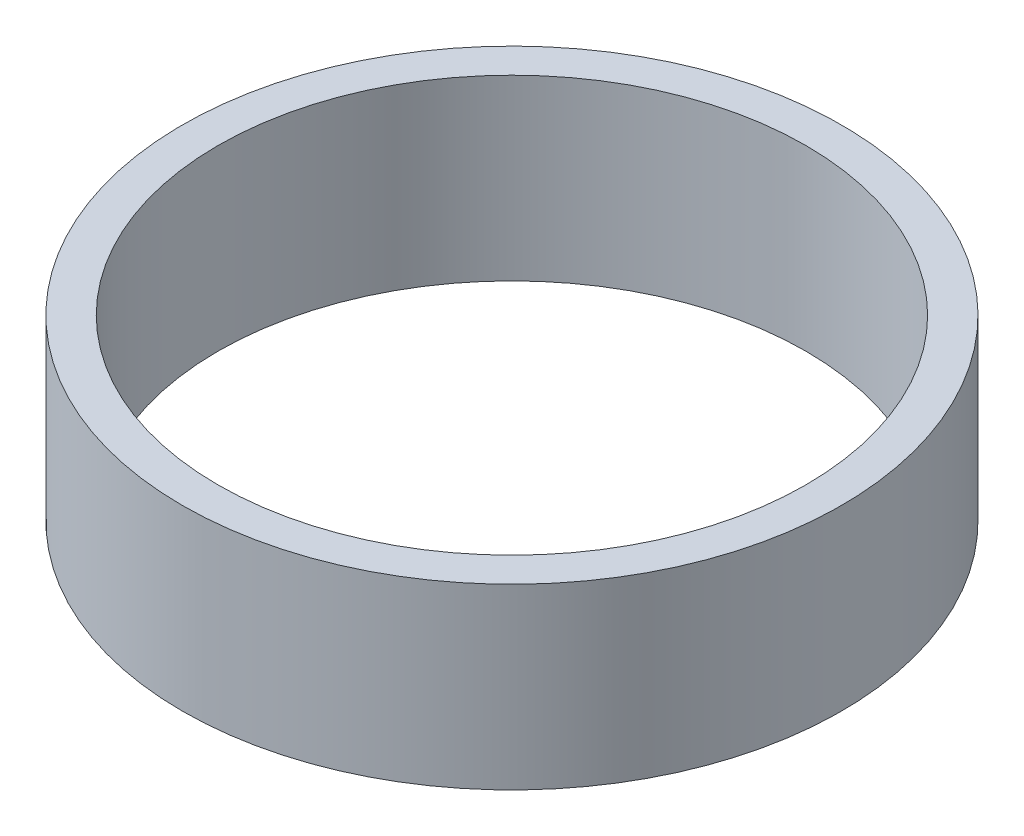
ISO-10303-21;
HEADER;
FILE_DESCRIPTION(('STEP AP214'),'2;1');
FILE_NAME('part.step','',(''),(''),'','','');
FILE_SCHEMA(('AUTOMOTIVE_DESIGN { 1 0 10303 214 1 1 1 1 }'));
ENDSEC;
DATA;
#1=APPLICATION_CONTEXT('core data for automotive mechanical design processes');
#2=APPLICATION_PROTOCOL_DEFINITION('international standard','automotive_design',2000,#1);
#3=PRODUCT_CONTEXT('',#1,'mechanical');
#4=PRODUCT('Part','Part','',(#3));
#5=PRODUCT_RELATED_PRODUCT_CATEGORY('part','',(#4));
#6=PRODUCT_DEFINITION_FORMATION('','',#4);
#7=PRODUCT_DEFINITION_CONTEXT('part definition',#1,'design');
#8=PRODUCT_DEFINITION('design','',#6,#7);
#9=PRODUCT_DEFINITION_SHAPE('','',#8);
#10=(LENGTH_UNIT() NAMED_UNIT(*) SI_UNIT(.MILLI.,.METRE.));
#11=(NAMED_UNIT(*) PLANE_ANGLE_UNIT() SI_UNIT($,.RADIAN.));
#12=(NAMED_UNIT(*) SI_UNIT($,.STERADIAN.) SOLID_ANGLE_UNIT());
#13=UNCERTAINTY_MEASURE_WITH_UNIT(LENGTH_MEASURE(1.E-05),#10,'distance_accuracy_value','');
#14=(GEOMETRIC_REPRESENTATION_CONTEXT(3) GLOBAL_UNCERTAINTY_ASSIGNED_CONTEXT((#13)) GLOBAL_UNIT_ASSIGNED_CONTEXT((#10,
#11,#12)) REPRESENTATION_CONTEXT('',''));
#15=CARTESIAN_POINT('',(0.,0.,0.));
#16=DIRECTION('',(0.,0.,1.));
#17=DIRECTION('',(1.,0.,0.));
#18=AXIS2_PLACEMENT_3D('',#15,#16,#17);
#19=CARTESIAN_POINT('',(0.,10.,0.));
#20=DIRECTION('',(0.,1.,0.));
#21=DIRECTION('',(0.,0.,1.));
#22=AXIS2_PLACEMENT_3D('',#19,#20,#21);
#23=PLANE('',#22);
#24=CARTESIAN_POINT('',(0.,10.,0.));
#25=DIRECTION('',(0.,1.,0.));
#26=DIRECTION('',(0.,0.,1.));
#27=AXIS2_PLACEMENT_3D('',#24,#25,#26);
#28=CIRCLE('',#27,18.5);
#29=CARTESIAN_POINT('',(0.,10.,18.5));
#30=VERTEX_POINT('',#29);
#31=EDGE_CURVE('E10',#30,#30,#28,.T.);
#32=ORIENTED_EDGE('',*,*,#31,.T.);
#33=EDGE_LOOP('',(#32));
#34=FACE_BOUND('',#33,.T.);
#35=CARTESIAN_POINT('',(0.,10.,0.));
#36=DIRECTION('',(0.,1.,0.));
#37=DIRECTION('',(0.,0.,1.));
#38=AXIS2_PLACEMENT_3D('',#35,#36,#37);
#39=CIRCLE('',#38,16.5);
#40=CARTESIAN_POINT('',(0.,10.,16.5));
#41=VERTEX_POINT('',#40);
#42=EDGE_CURVE('E42',#41,#41,#39,.T.);
#43=ORIENTED_EDGE('',*,*,#42,.F.);
#44=EDGE_LOOP('',(#43));
#45=FACE_BOUND('',#44,.T.);
#46=ADVANCED_FACE('F31',(#34,#45),#23,.T.);
#47=CARTESIAN_POINT('',(0.,0.,0.));
#48=DIRECTION('',(0.,1.,0.));
#49=DIRECTION('',(0.,0.,1.));
#50=AXIS2_PLACEMENT_3D('',#47,#48,#49);
#51=PLANE('',#50);
#52=CARTESIAN_POINT('',(0.,0.,0.));
#53=DIRECTION('',(0.,1.,0.));
#54=DIRECTION('',(0.,0.,1.));
#55=AXIS2_PLACEMENT_3D('',#52,#53,#54);
#56=CIRCLE('',#55,18.5);
#57=CARTESIAN_POINT('',(0.,0.,18.5));
#58=VERTEX_POINT('',#57);
#59=EDGE_CURVE('E35',#58,#58,#56,.T.);
#60=ORIENTED_EDGE('',*,*,#59,.F.);
#61=EDGE_LOOP('',(#60));
#62=FACE_BOUND('',#61,.T.);
#63=CARTESIAN_POINT('',(0.,0.,0.));
#64=DIRECTION('',(0.,1.,0.));
#65=DIRECTION('',(0.,0.,1.));
#66=AXIS2_PLACEMENT_3D('',#63,#64,#65);
#67=CIRCLE('',#66,16.5);
#68=CARTESIAN_POINT('',(0.,0.,16.5));
#69=VERTEX_POINT('',#68);
#70=EDGE_CURVE('E44',#69,#69,#67,.T.);
#71=ORIENTED_EDGE('',*,*,#70,.T.);
#72=EDGE_LOOP('',(#71));
#73=FACE_BOUND('',#72,.T.);
#74=ADVANCED_FACE('F54',(#62,#73),#51,.F.);
#75=CARTESIAN_POINT('',(0.,10.,0.));
#76=DIRECTION('',(0.,-1.,0.));
#77=DIRECTION('',(0.,0.,-1.));
#78=AXIS2_PLACEMENT_3D('',#75,#76,#77);
#79=CYLINDRICAL_SURFACE('',#78,18.5);
#80=ORIENTED_EDGE('',*,*,#31,.F.);
#81=EDGE_LOOP('',(#80));
#82=FACE_BOUND('',#81,.T.);
#83=ORIENTED_EDGE('',*,*,#59,.T.);
#84=EDGE_LOOP('',(#83));
#85=FACE_BOUND('',#84,.T.);
#86=ADVANCED_FACE('F33',(#82,#85),#79,.T.);
#87=CARTESIAN_POINT('',(0.,10.,0.));
#88=DIRECTION('',(0.,-1.,0.));
#89=DIRECTION('',(0.,0.,-1.));
#90=AXIS2_PLACEMENT_3D('',#87,#88,#89);
#91=CYLINDRICAL_SURFACE('',#90,16.5);
#92=ORIENTED_EDGE('',*,*,#42,.T.);
#93=EDGE_LOOP('',(#92));
#94=FACE_BOUND('',#93,.T.);
#95=ORIENTED_EDGE('',*,*,#70,.F.);
#96=EDGE_LOOP('',(#95));
#97=FACE_BOUND('',#96,.T.);
#98=ADVANCED_FACE('F50',(#94,#97),#91,.F.);
#99=CLOSED_SHELL('',(#46,#74,#86,#98));
#100=MANIFOLD_SOLID_BREP('B2',#99);
#101=ADVANCED_BREP_SHAPE_REPRESENTATION('',(#18,#100),#14);
#102=SHAPE_DEFINITION_REPRESENTATION(#9,#101);
ENDSEC;
END-ISO-10303-21;
